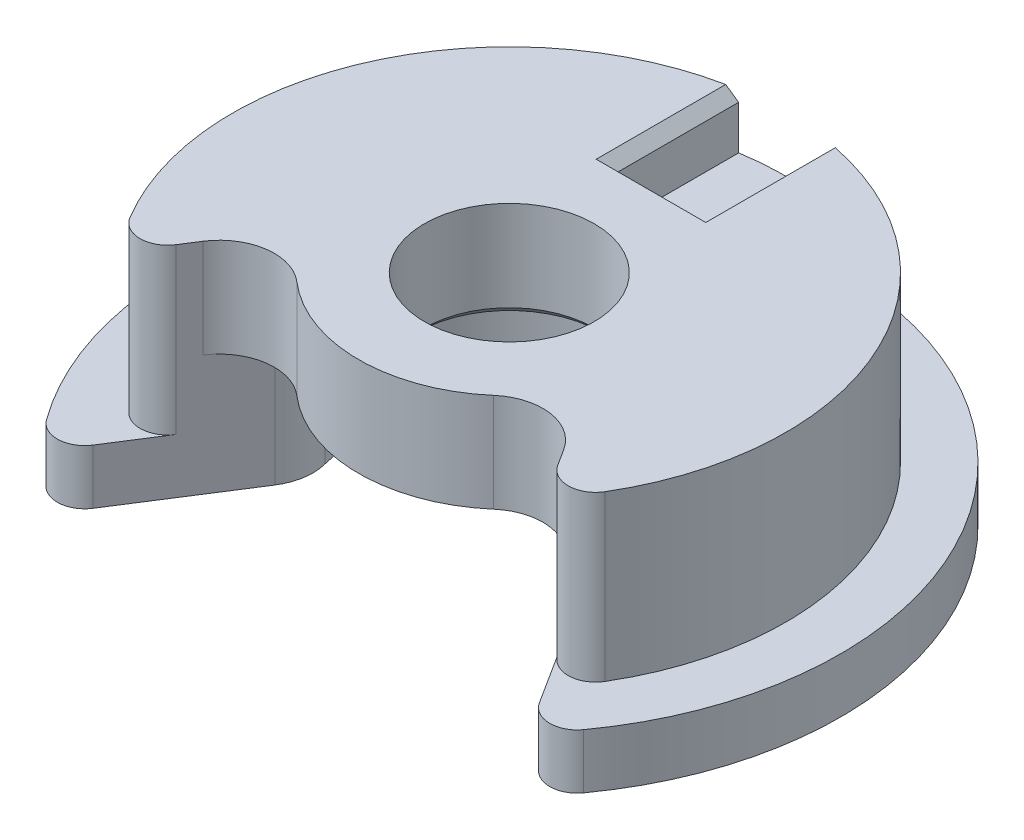
ISO-10303-21;
HEADER;
FILE_DESCRIPTION(('STEP AP214'),'2;1');
FILE_NAME('part.step','',(''),(''),'','','');
FILE_SCHEMA(('AUTOMOTIVE_DESIGN { 1 0 10303 214 1 1 1 1 }'));
ENDSEC;
DATA;
#1=APPLICATION_CONTEXT('core data for automotive mechanical design processes');
#2=APPLICATION_PROTOCOL_DEFINITION('international standard','automotive_design',2000,#1);
#3=PRODUCT_CONTEXT('',#1,'mechanical');
#4=PRODUCT('Part','Part','',(#3));
#5=PRODUCT_RELATED_PRODUCT_CATEGORY('part','',(#4));
#6=PRODUCT_DEFINITION_FORMATION('','',#4);
#7=PRODUCT_DEFINITION_CONTEXT('part definition',#1,'design');
#8=PRODUCT_DEFINITION('design','',#6,#7);
#9=PRODUCT_DEFINITION_SHAPE('','',#8);
#10=(LENGTH_UNIT() NAMED_UNIT(*) SI_UNIT(.MILLI.,.METRE.));
#11=(NAMED_UNIT(*) PLANE_ANGLE_UNIT() SI_UNIT($,.RADIAN.));
#12=(NAMED_UNIT(*) SI_UNIT($,.STERADIAN.) SOLID_ANGLE_UNIT());
#13=UNCERTAINTY_MEASURE_WITH_UNIT(LENGTH_MEASURE(1.E-05),#10,'distance_accuracy_value','');
#14=(GEOMETRIC_REPRESENTATION_CONTEXT(3) GLOBAL_UNCERTAINTY_ASSIGNED_CONTEXT((#13)) GLOBAL_UNIT_ASSIGNED_CONTEXT((#10,
#11,#12)) REPRESENTATION_CONTEXT('',''));
#15=CARTESIAN_POINT('',(0.,0.,0.));
#16=DIRECTION('',(0.,0.,1.));
#17=DIRECTION('',(1.,0.,0.));
#18=AXIS2_PLACEMENT_3D('',#15,#16,#17);
#19=CARTESIAN_POINT('',(0.,3.,0.));
#20=DIRECTION('',(0.,1.,0.));
#21=DIRECTION('',(0.,0.,1.));
#22=AXIS2_PLACEMENT_3D('',#19,#20,#21);
#23=PLANE('',#22);
#24=DIRECTION('',(0.,0.,-1.));
#25=VECTOR('',#24,1.);
#26=CARTESIAN_POINT('',(0.8,3.,-2.786231041578));
#27=LINE('',#26,#25);
#28=CARTESIAN_POINT('',(0.8,3.,-2.786231041578));
#29=VERTEX_POINT('',#28);
#30=CARTESIAN_POINT('',(0.8,3.,-4.9862310415782));
#31=VERTEX_POINT('',#30);
#32=EDGE_CURVE('E225',#29,#31,#27,.T.);
#33=ORIENTED_EDGE('',*,*,#32,.T.);
#34=CARTESIAN_POINT('',(0.,3.,0.));
#35=DIRECTION('',(0.,-1.,0.));
#36=DIRECTION('',(0.,0.,-1.));
#37=AXIS2_PLACEMENT_3D('',#34,#35,#36);
#38=CIRCLE('',#37,5.05);
#39=CARTESIAN_POINT('',(-0.8,3.,-4.9862310415782));
#40=VERTEX_POINT('',#39);
#41=EDGE_CURVE('E19',#31,#40,#38,.F.);
#42=ORIENTED_EDGE('',*,*,#41,.T.);
#43=DIRECTION('',(0.,0.,1.));
#44=VECTOR('',#43,1.);
#45=CARTESIAN_POINT('',(-0.8,3.,-4.986231041578));
#46=LINE('',#45,#44);
#47=CARTESIAN_POINT('',(-0.8,3.,-2.786231041578));
#48=VERTEX_POINT('',#47);
#49=EDGE_CURVE('E234',#40,#48,#46,.T.);
#50=ORIENTED_EDGE('',*,*,#49,.T.);
#51=DIRECTION('',(1.,0.,0.));
#52=VECTOR('',#51,1.);
#53=CARTESIAN_POINT('',(-0.8,3.,-2.786231041578));
#54=LINE('',#53,#52);
#55=EDGE_CURVE('E158',#48,#29,#54,.T.);
#56=ORIENTED_EDGE('',*,*,#55,.T.);
#57=EDGE_LOOP('',(#33,#42,#50,#56));
#58=FACE_BOUND('',#57,.T.);
#59=ADVANCED_FACE('F16',(#58),#23,.T.);
#60=CARTESIAN_POINT('',(-0.8,4.,-2.786231041578));
#61=DIRECTION('',(0.,0.,1.));
#62=DIRECTION('',(1.,0.,0.));
#63=AXIS2_PLACEMENT_3D('',#60,#61,#62);
#64=PLANE('',#63);
#65=ORIENTED_EDGE('',*,*,#55,.F.);
#66=DIRECTION('',(0.,1.,0.));
#67=VECTOR('',#66,1.);
#68=CARTESIAN_POINT('',(-0.8,4.,-2.786231041578));
#69=LINE('',#68,#67);
#70=CARTESIAN_POINT('',(-0.800000000000001,3.8,-2.786231041578));
#71=VERTEX_POINT('',#70);
#72=EDGE_CURVE('E229',#48,#71,#69,.T.);
#73=ORIENTED_EDGE('',*,*,#72,.T.);
#74=DIRECTION('',(1.,0.,0.));
#75=VECTOR('',#74,1.);
#76=CARTESIAN_POINT('',(0.,3.8,-2.786231041578));
#77=LINE('',#76,#75);
#78=CARTESIAN_POINT('',(0.8,3.8,-2.786231041578));
#79=VERTEX_POINT('',#78);
#80=EDGE_CURVE('E217',#79,#71,#77,.F.);
#81=ORIENTED_EDGE('',*,*,#80,.F.);
#82=DIRECTION('',(0.,1.,0.));
#83=VECTOR('',#82,1.);
#84=CARTESIAN_POINT('',(0.8,4.,-2.786231041578));
#85=LINE('',#84,#83);
#86=EDGE_CURVE('E226',#79,#29,#85,.F.);
#87=ORIENTED_EDGE('',*,*,#86,.T.);
#88=EDGE_LOOP('',(#65,#73,#81,#87));
#89=FACE_BOUND('',#88,.T.);
#90=ADVANCED_FACE('F408',(#89),#64,.F.);
#91=CARTESIAN_POINT('',(-0.8,4.,-4.986231041578));
#92=DIRECTION('',(-1.,0.,0.));
#93=DIRECTION('',(0.,0.,1.));
#94=AXIS2_PLACEMENT_3D('',#91,#92,#93);
#95=PLANE('',#94);
#96=ORIENTED_EDGE('',*,*,#49,.F.);
#97=DIRECTION('',(0.,1.,0.));
#98=VECTOR('',#97,1.);
#99=CARTESIAN_POINT('',(-0.8,4.,-4.986231041578));
#100=LINE('',#99,#98);
#101=CARTESIAN_POINT('',(-0.8,3.8,-4.9862310415782));
#102=VERTEX_POINT('',#101);
#103=EDGE_CURVE('E232',#102,#40,#100,.F.);
#104=ORIENTED_EDGE('',*,*,#103,.F.);
#105=DIRECTION('',(0.,0.,1.));
#106=VECTOR('',#105,1.);
#107=CARTESIAN_POINT('',(-0.8,3.8,-3.868115520789));
#108=LINE('',#107,#106);
#109=EDGE_CURVE('E210',#71,#102,#108,.F.);
#110=ORIENTED_EDGE('',*,*,#109,.F.);
#111=ORIENTED_EDGE('',*,*,#72,.F.);
#112=EDGE_LOOP('',(#96,#104,#110,#111));
#113=FACE_BOUND('',#112,.T.);
#114=ADVANCED_FACE('F649',(#113),#95,.F.);
#115=CARTESIAN_POINT('',(0.8,4.,-2.786231041578));
#116=DIRECTION('',(1.,0.,0.));
#117=DIRECTION('',(0.,0.,-1.));
#118=AXIS2_PLACEMENT_3D('',#115,#116,#117);
#119=PLANE('',#118);
#120=ORIENTED_EDGE('',*,*,#32,.F.);
#121=ORIENTED_EDGE('',*,*,#86,.F.);
#122=DIRECTION('',(0.,0.,1.));
#123=VECTOR('',#122,1.);
#124=CARTESIAN_POINT('',(0.8,3.8,-3.868115520789));
#125=LINE('',#124,#123);
#126=CARTESIAN_POINT('',(0.8,3.8,-4.9862310415782));
#127=VERTEX_POINT('',#126);
#128=EDGE_CURVE('E178',#127,#79,#125,.T.);
#129=ORIENTED_EDGE('',*,*,#128,.F.);
#130=DIRECTION('',(0.,1.,0.));
#131=VECTOR('',#130,1.);
#132=CARTESIAN_POINT('',(0.8,4.,-4.986231041578));
#133=LINE('',#132,#131);
#134=EDGE_CURVE('E221',#31,#127,#133,.T.);
#135=ORIENTED_EDGE('',*,*,#134,.F.);
#136=EDGE_LOOP('',(#120,#121,#129,#135));
#137=FACE_BOUND('',#136,.T.);
#138=ADVANCED_FACE('F406',(#137),#119,.F.);
#139=CARTESIAN_POINT('',(0.,3.9,-2.686231041578));
#140=DIRECTION('',(0.,0.707106781186548,-0.707106781186548));
#141=DIRECTION('',(0.,0.707106781186548,0.707106781186548));
#142=AXIS2_PLACEMENT_3D('',#139,#140,#141);
#143=PLANE('',#142);
#144=DIRECTION('',(0.577350269189625,-0.577350269189625,-0.577350269189627));
#145=VECTOR('',#144,1.);
#146=CARTESIAN_POINT('',(-1.,4.,-2.586231041578));
#147=LINE('',#146,#145);
#148=CARTESIAN_POINT('',(-1.,4.,-2.586231041578));
#149=VERTEX_POINT('',#148);
#150=EDGE_CURVE('E196',#149,#71,#147,.T.);
#151=ORIENTED_EDGE('',*,*,#150,.F.);
#152=DIRECTION('',(1.,0.,0.));
#153=VECTOR('',#152,1.);
#154=CARTESIAN_POINT('',(0.,4.,-2.586231041578));
#155=LINE('',#154,#153);
#156=CARTESIAN_POINT('',(1.,4.,-2.586231041578));
#157=VERTEX_POINT('',#156);
#158=EDGE_CURVE('E187',#157,#149,#155,.F.);
#159=ORIENTED_EDGE('',*,*,#158,.F.);
#160=DIRECTION('',(0.577350269189625,0.577350269189625,0.577350269189627));
#161=VECTOR('',#160,1.);
#162=CARTESIAN_POINT('',(0.8,3.8,-2.786231041578));
#163=LINE('',#162,#161);
#164=EDGE_CURVE('E171',#79,#157,#163,.T.);
#165=ORIENTED_EDGE('',*,*,#164,.F.);
#166=ORIENTED_EDGE('',*,*,#80,.T.);
#167=EDGE_LOOP('',(#151,#159,#165,#166));
#168=FACE_BOUND('',#167,.T.);
#169=ADVANCED_FACE('F194',(#168),#143,.T.);
#170=CARTESIAN_POINT('',(-0.9,3.9,-3.868115520789));
#171=DIRECTION('',(0.707106781186548,0.707106781186548,0.));
#172=DIRECTION('',(-0.707106781186548,0.707106781186548,0.));
#173=AXIS2_PLACEMENT_3D('',#170,#171,#172);
#174=PLANE('',#173);
#175=ORIENTED_EDGE('',*,*,#109,.T.);
#176=CARTESIAN_POINT('',(0.,3.,0.));
#177=DIRECTION('',(0.707106781186548,0.707106781186548,0.));
#178=DIRECTION('',(0.707106781186548,-0.707106781186548,0.));
#179=AXIS2_PLACEMENT_3D('',#176,#177,#178);
#180=ELLIPSE('',#179,7.14177848998413,5.05);
#181=CARTESIAN_POINT('',(-1.,4.,-4.95));
#182=VERTEX_POINT('',#181);
#183=EDGE_CURVE('E213',#102,#182,#180,.T.);
#184=ORIENTED_EDGE('',*,*,#183,.T.);
#185=DIRECTION('',(0.,0.,1.));
#186=VECTOR('',#185,1.);
#187=CARTESIAN_POINT('',(-1.,4.,0.));
#188=LINE('',#187,#186);
#189=EDGE_CURVE('E198',#149,#182,#188,.F.);
#190=ORIENTED_EDGE('',*,*,#189,.F.);
#191=ORIENTED_EDGE('',*,*,#150,.T.);
#192=EDGE_LOOP('',(#175,#184,#190,#191));
#193=FACE_BOUND('',#192,.T.);
#194=ADVANCED_FACE('F411',(#193),#174,.T.);
#195=CARTESIAN_POINT('',(0.9,3.9,-3.868115520789));
#196=DIRECTION('',(-0.707106781186548,0.707106781186548,0.));
#197=DIRECTION('',(-0.707106781186548,-0.707106781186548,0.));
#198=AXIS2_PLACEMENT_3D('',#195,#196,#197);
#199=PLANE('',#198);
#200=DIRECTION('',(0.,0.,1.));
#201=VECTOR('',#200,1.);
#202=CARTESIAN_POINT('',(1.,4.,0.));
#203=LINE('',#202,#201);
#204=CARTESIAN_POINT('',(1.,4.,-4.95));
#205=VERTEX_POINT('',#204);
#206=EDGE_CURVE('E175',#205,#157,#203,.T.);
#207=ORIENTED_EDGE('',*,*,#206,.F.);
#208=CARTESIAN_POINT('',(0.,3.,0.));
#209=DIRECTION('',(-0.707106781186548,0.707106781186548,0.));
#210=DIRECTION('',(-0.707106781186548,-0.707106781186548,0.));
#211=AXIS2_PLACEMENT_3D('',#208,#209,#210);
#212=ELLIPSE('',#211,7.14177848998413,5.05);
#213=EDGE_CURVE('E182',#205,#127,#212,.T.);
#214=ORIENTED_EDGE('',*,*,#213,.T.);
#215=ORIENTED_EDGE('',*,*,#128,.T.);
#216=ORIENTED_EDGE('',*,*,#164,.T.);
#217=EDGE_LOOP('',(#207,#214,#215,#216));
#218=FACE_BOUND('',#217,.T.);
#219=ADVANCED_FACE('F173',(#218),#199,.T.);
#220=CARTESIAN_POINT('',(0.,0.,0.));
#221=DIRECTION('',(0.,-1.,0.));
#222=DIRECTION('',(0.,0.,-1.));
#223=AXIS2_PLACEMENT_3D('',#220,#221,#222);
#224=CYLINDRICAL_SURFACE('',#223,1.55);
#225=CARTESIAN_POINT('',(0.,4.,0.));
#226=DIRECTION('',(0.,-1.,0.));
#227=DIRECTION('',(0.,0.,-1.));
#228=AXIS2_PLACEMENT_3D('',#225,#226,#227);
#229=CIRCLE('',#228,1.55);
#230=CARTESIAN_POINT('',(0.,4.,-1.55));
#231=VERTEX_POINT('',#230);
#232=EDGE_CURVE('E191',#231,#231,#229,.T.);
#233=ORIENTED_EDGE('',*,*,#232,.F.);
#234=EDGE_LOOP('',(#233));
#235=FACE_BOUND('',#234,.T.);
#236=CARTESIAN_POINT('',(0.,2.35000000003538,0.));
#237=DIRECTION('',(0.,-1.,0.));
#238=DIRECTION('',(0.,0.,-1.));
#239=AXIS2_PLACEMENT_3D('',#236,#237,#238);
#240=CIRCLE('',#239,1.55000000000882);
#241=CARTESIAN_POINT('',(0.,2.35000000003538,-1.55000000000882));
#242=VERTEX_POINT('',#241);
#243=EDGE_CURVE('E199',#242,#242,#240,.T.);
#244=ORIENTED_EDGE('',*,*,#243,.T.);
#245=EDGE_LOOP('',(#244));
#246=FACE_BOUND('',#245,.T.);
#247=ADVANCED_FACE('F454',(#235,#246),#224,.F.);
#248=CARTESIAN_POINT('',(0.,2.20000000007303,0.));
#249=DIRECTION('',(0.,-1.,0.));
#250=DIRECTION('',(0.,0.,-1.));
#251=AXIS2_PLACEMENT_3D('',#248,#249,#250);
#252=CONICAL_SURFACE('',#251,1.69999999997117,0.785398163397448);
#253=CARTESIAN_POINT('',(0.,2.20000000007303,0.));
#254=DIRECTION('',(0.,-1.,0.));
#255=DIRECTION('',(0.,0.,-1.));
#256=AXIS2_PLACEMENT_3D('',#253,#254,#255);
#257=CIRCLE('',#256,1.69999999997117);
#258=CARTESIAN_POINT('',(0.,2.20000000007303,-1.69999999997117));
#259=VERTEX_POINT('',#258);
#260=EDGE_CURVE('E294',#259,#259,#257,.F.);
#261=ORIENTED_EDGE('',*,*,#260,.F.);
#262=EDGE_LOOP('',(#261));
#263=FACE_BOUND('',#262,.T.);
#264=ORIENTED_EDGE('',*,*,#243,.F.);
#265=EDGE_LOOP('',(#264));
#266=FACE_BOUND('',#265,.T.);
#267=ADVANCED_FACE('F445',(#263,#266),#252,.F.);
#268=CARTESIAN_POINT('',(0.,0.,0.));
#269=DIRECTION('',(0.,-1.,0.));
#270=DIRECTION('',(0.,0.,-1.));
#271=AXIS2_PLACEMENT_3D('',#268,#269,#270);
#272=CYLINDRICAL_SURFACE('',#271,2.75);
#273=CARTESIAN_POINT('',(0.,2.2,0.));
#274=DIRECTION('',(0.,-1.,0.));
#275=DIRECTION('',(0.,0.,-1.));
#276=AXIS2_PLACEMENT_3D('',#273,#274,#275);
#277=CIRCLE('',#276,2.75);
#278=CARTESIAN_POINT('',(1.7973072600179,2.2,2.081390547948));
#279=VERTEX_POINT('',#278);
#280=CARTESIAN_POINT('',(-1.7973072600179,2.2,2.081390547948));
#281=VERTEX_POINT('',#280);
#282=EDGE_CURVE('E301',#279,#281,#277,.T.);
#283=ORIENTED_EDGE('',*,*,#282,.F.);
#284=DIRECTION('',(0.,1.,0.));
#285=VECTOR('',#284,1.);
#286=CARTESIAN_POINT('',(1.797307260018,-5.2144,2.081390547948));
#287=LINE('',#286,#285);
#288=CARTESIAN_POINT('',(1.7973072600179,4.,2.081390547948));
#289=VERTEX_POINT('',#288);
#290=EDGE_CURVE('E286',#279,#289,#287,.T.);
#291=ORIENTED_EDGE('',*,*,#290,.T.);
#292=CARTESIAN_POINT('',(0.,4.,0.));
#293=DIRECTION('',(0.,-1.,0.));
#294=DIRECTION('',(0.,0.,-1.));
#295=AXIS2_PLACEMENT_3D('',#292,#293,#294);
#296=CIRCLE('',#295,2.75);
#297=CARTESIAN_POINT('',(-1.7973072600179,4.,2.081390547948));
#298=VERTEX_POINT('',#297);
#299=EDGE_CURVE('E322',#298,#289,#296,.F.);
#300=ORIENTED_EDGE('',*,*,#299,.F.);
#301=DIRECTION('',(0.,1.,0.));
#302=VECTOR('',#301,1.);
#303=CARTESIAN_POINT('',(-1.797307260018,-5.2144,2.081390547948));
#304=LINE('',#303,#302);
#305=EDGE_CURVE('E309',#298,#281,#304,.F.);
#306=ORIENTED_EDGE('',*,*,#305,.T.);
#307=EDGE_LOOP('',(#283,#291,#300,#306));
#308=FACE_BOUND('',#307,.T.);
#309=ADVANCED_FACE('F443',(#308),#272,.T.);
#310=CARTESIAN_POINT('',(0.,4.,0.));
#311=DIRECTION('',(0.,1.,0.));
#312=DIRECTION('',(0.,0.,1.));
#313=AXIS2_PLACEMENT_3D('',#310,#311,#312);
#314=PLANE('',#313);
#315=ORIENTED_EDGE('',*,*,#232,.T.);
#316=EDGE_LOOP('',(#315));
#317=FACE_BOUND('',#316,.T.);
#318=CARTESIAN_POINT('',(0.,4.,0.));
#319=DIRECTION('',(0.,-1.,0.));
#320=DIRECTION('',(0.,0.,-1.));
#321=AXIS2_PLACEMENT_3D('',#318,#319,#320);
#322=CIRCLE('',#321,5.05);
#323=CARTESIAN_POINT('',(4.33625103973418,4.,2.5883251187598));
#324=VERTEX_POINT('',#323);
#325=EDGE_CURVE('E190',#205,#324,#322,.T.);
#326=ORIENTED_EDGE('',*,*,#325,.F.);
#327=ORIENTED_EDGE('',*,*,#206,.T.);
#328=ORIENTED_EDGE('',*,*,#158,.T.);
#329=ORIENTED_EDGE('',*,*,#189,.T.);
#330=CARTESIAN_POINT('',(0.,4.,0.));
#331=DIRECTION('',(0.,-1.,0.));
#332=DIRECTION('',(0.,0.,-1.));
#333=AXIS2_PLACEMENT_3D('',#330,#331,#332);
#334=CIRCLE('',#333,5.05);
#335=CARTESIAN_POINT('',(-4.33625103973424,4.,2.58832511875984));
#336=VERTEX_POINT('',#335);
#337=EDGE_CURVE('E314',#336,#182,#334,.T.);
#338=ORIENTED_EDGE('',*,*,#337,.F.);
#339=CARTESIAN_POINT('',(-3.906919253622,4.,2.332055305021));
#340=DIRECTION('',(0.,1.,0.));
#341=DIRECTION('',(0.,0.,1.));
#342=AXIS2_PLACEMENT_3D('',#339,#340,#341);
#343=CIRCLE('',#342,0.5);
#344=CARTESIAN_POINT('',(-3.48522353071745,4.,2.60070510919377));
#345=VERTEX_POINT('',#344);
#346=EDGE_CURVE('E310',#345,#336,#343,.F.);
#347=ORIENTED_EDGE('',*,*,#346,.F.);
#348=DIRECTION('',(0.537299608347189,0.,-0.843391445812653));
#349=VECTOR('',#348,1.);
#350=CARTESIAN_POINT('',(-3.485223530716,4.,2.600705109195));
#351=LINE('',#350,#349);
#352=CARTESIAN_POINT('',(-3.29426498220257,4.,2.3009602297628));
#353=VERTEX_POINT('',#352);
#354=EDGE_CURVE('E201',#345,#353,#351,.T.);
#355=ORIENTED_EDGE('',*,*,#354,.T.);
#356=CARTESIAN_POINT('',(-2.450873536388,4.,2.838259838111));
#357=DIRECTION('',(0.,1.,0.));
#358=DIRECTION('',(0.,0.,1.));
#359=AXIS2_PLACEMENT_3D('',#356,#357,#358);
#360=CIRCLE('',#359,1.);
#361=EDGE_CURVE('E306',#353,#298,#360,.F.);
#362=ORIENTED_EDGE('',*,*,#361,.T.);
#363=ORIENTED_EDGE('',*,*,#299,.T.);
#364=CARTESIAN_POINT('',(2.450873536388,4.,2.838259838111));
#365=DIRECTION('',(0.,1.,0.));
#366=DIRECTION('',(0.,0.,1.));
#367=AXIS2_PLACEMENT_3D('',#364,#365,#366);
#368=CIRCLE('',#367,1.);
#369=CARTESIAN_POINT('',(3.29426498220077,4.,2.30096022976394));
#370=VERTEX_POINT('',#369);
#371=EDGE_CURVE('E283',#289,#370,#368,.F.);
#372=ORIENTED_EDGE('',*,*,#371,.T.);
#373=DIRECTION('',(0.537299608347189,0.,0.843391445812653));
#374=VECTOR('',#373,1.);
#375=CARTESIAN_POINT('',(3.294264982201,4.,2.300960229764));
#376=LINE('',#375,#374);
#377=CARTESIAN_POINT('',(3.48522353071566,4.,2.60070510919491));
#378=VERTEX_POINT('',#377);
#379=EDGE_CURVE('E321',#370,#378,#376,.T.);
#380=ORIENTED_EDGE('',*,*,#379,.T.);
#381=CARTESIAN_POINT('',(3.906919253622,4.,2.332055305021));
#382=DIRECTION('',(0.,-1.,0.));
#383=DIRECTION('',(0.,0.,-1.));
#384=AXIS2_PLACEMENT_3D('',#381,#382,#383);
#385=CIRCLE('',#384,0.5);
#386=EDGE_CURVE('E192',#378,#324,#385,.F.);
#387=ORIENTED_EDGE('',*,*,#386,.T.);
#388=EDGE_LOOP('',(#326,#327,#328,#329,#338,#347,#355,#362,#363,#372,#380,#387));
#389=FACE_BOUND('',#388,.T.);
#390=ADVANCED_FACE('F185',(#317,#389),#314,.T.);
#391=CARTESIAN_POINT('',(0.,1.,0.));
#392=DIRECTION('',(0.,-1.,0.));
#393=DIRECTION('',(0.,0.,-1.));
#394=AXIS2_PLACEMENT_3D('',#391,#392,#393);
#395=CYLINDRICAL_SURFACE('',#394,5.05);
#396=ORIENTED_EDGE('',*,*,#134,.T.);
#397=ORIENTED_EDGE('',*,*,#213,.F.);
#398=ORIENTED_EDGE('',*,*,#325,.T.);
#399=DIRECTION('',(0.,-1.,0.));
#400=VECTOR('',#399,1.);
#401=CARTESIAN_POINT('',(4.33625103973405,9.2144,2.58832511876003));
#402=LINE('',#401,#400);
#403=CARTESIAN_POINT('',(4.33625103973424,1.,2.58832511875984));
#404=VERTEX_POINT('',#403);
#405=EDGE_CURVE('E282',#404,#324,#402,.F.);
#406=ORIENTED_EDGE('',*,*,#405,.F.);
#407=CARTESIAN_POINT('',(0.,1.,0.));
#408=DIRECTION('',(0.,-1.,0.));
#409=DIRECTION('',(0.,0.,-1.));
#410=AXIS2_PLACEMENT_3D('',#407,#408,#409);
#411=CIRCLE('',#410,5.05);
#412=CARTESIAN_POINT('',(-4.33625103973418,1.,2.5883251187598));
#413=VERTEX_POINT('',#412);
#414=EDGE_CURVE('E276',#404,#413,#411,.F.);
#415=ORIENTED_EDGE('',*,*,#414,.T.);
#416=DIRECTION('',(0.,1.,0.));
#417=VECTOR('',#416,1.);
#418=CARTESIAN_POINT('',(-4.33625103973405,-5.2144,2.58832511876003));
#419=LINE('',#418,#417);
#420=EDGE_CURVE('E313',#336,#413,#419,.F.);
#421=ORIENTED_EDGE('',*,*,#420,.F.);
#422=ORIENTED_EDGE('',*,*,#337,.T.);
#423=ORIENTED_EDGE('',*,*,#183,.F.);
#424=ORIENTED_EDGE('',*,*,#103,.T.);
#425=ORIENTED_EDGE('',*,*,#41,.F.);
#426=EDGE_LOOP('',(#396,#397,#398,#406,#415,#421,#422,#423,#424,#425));
#427=FACE_BOUND('',#426,.T.);
#428=ADVANCED_FACE('F404',(#427),#395,.T.);
#429=CARTESIAN_POINT('',(-3.906919253622,-5.2144,2.332055305021));
#430=DIRECTION('',(0.,1.,0.));
#431=DIRECTION('',(0.,0.,1.));
#432=AXIS2_PLACEMENT_3D('',#429,#430,#431);
#433=CYLINDRICAL_SURFACE('',#432,0.5);
#434=DIRECTION('',(0.,1.,0.));
#435=VECTOR('',#434,1.);
#436=CARTESIAN_POINT('',(-3.48522353071918,0.,2.60070510919297));
#437=LINE('',#436,#435);
#438=CARTESIAN_POINT('',(-3.48522353071898,1.,2.60070510919266));
#439=VERTEX_POINT('',#438);
#440=EDGE_CURVE('E272',#439,#345,#437,.T.);
#441=ORIENTED_EDGE('',*,*,#440,.T.);
#442=ORIENTED_EDGE('',*,*,#346,.T.);
#443=ORIENTED_EDGE('',*,*,#420,.T.);
#444=CARTESIAN_POINT('',(-3.906919253622,1.,2.332055305021));
#445=DIRECTION('',(0.,1.,0.));
#446=DIRECTION('',(0.,0.,1.));
#447=AXIS2_PLACEMENT_3D('',#444,#445,#446);
#448=CIRCLE('',#447,0.5);
#449=EDGE_CURVE('E273',#413,#439,#448,.T.);
#450=ORIENTED_EDGE('',*,*,#449,.T.);
#451=EDGE_LOOP('',(#441,#442,#443,#450));
#452=FACE_BOUND('',#451,.T.);
#453=ADVANCED_FACE('F416',(#452),#433,.T.);
#454=CARTESIAN_POINT('',(-2.450873536388,-5.2144,2.838259838111));
#455=DIRECTION('',(0.,1.,0.));
#456=DIRECTION('',(0.,0.,1.));
#457=AXIS2_PLACEMENT_3D('',#454,#455,#456);
#458=CYLINDRICAL_SURFACE('',#457,1.);
#459=DIRECTION('',(0.,1.,0.));
#460=VECTOR('',#459,1.);
#461=CARTESIAN_POINT('',(-3.29426498220432,0.,2.30096022976188));
#462=LINE('',#461,#460);
#463=CARTESIAN_POINT('',(-3.29426498220435,2.2,2.30096022976193));
#464=VERTEX_POINT('',#463);
#465=EDGE_CURVE('E347',#353,#464,#462,.F.);
#466=ORIENTED_EDGE('',*,*,#465,.T.);
#467=CARTESIAN_POINT('',(-2.450873536388,2.2,2.838259838111));
#468=DIRECTION('',(0.,1.,0.));
#469=DIRECTION('',(0.,0.,1.));
#470=AXIS2_PLACEMENT_3D('',#467,#468,#469);
#471=CIRCLE('',#470,1.);
#472=EDGE_CURVE('E299',#281,#464,#471,.T.);
#473=ORIENTED_EDGE('',*,*,#472,.F.);
#474=ORIENTED_EDGE('',*,*,#305,.F.);
#475=ORIENTED_EDGE('',*,*,#361,.F.);
#476=EDGE_LOOP('',(#466,#473,#474,#475));
#477=FACE_BOUND('',#476,.T.);
#478=ADVANCED_FACE('F433',(#477),#458,.F.);
#479=CARTESIAN_POINT('',(-3.625222931046,9.2144,0.9593011519948));
#480=DIRECTION('',(0.,-1.,0.));
#481=DIRECTION('',(0.,0.,-1.));
#482=AXIS2_PLACEMENT_3D('',#479,#480,#481);
#483=CYLINDRICAL_SURFACE('',#482,1.);
#484=DIRECTION('',(0.,1.,0.));
#485=VECTOR('',#484,1.);
#486=CARTESIAN_POINT('',(-2.78183148523659,0.,1.49660076033971));
#487=LINE('',#486,#485);
#488=CARTESIAN_POINT('',(-2.78183148523651,2.2,1.49660076033959));
#489=VERTEX_POINT('',#488);
#490=CARTESIAN_POINT('',(-2.78183148523472,0.,1.49660076034074));
#491=VERTEX_POINT('',#490);
#492=EDGE_CURVE('E353',#489,#491,#487,.F.);
#493=ORIENTED_EDGE('',*,*,#492,.T.);
#494=CARTESIAN_POINT('',(-3.625222931046,0.,0.9593011519948));
#495=DIRECTION('',(0.,-1.,0.));
#496=DIRECTION('',(0.,0.,-1.));
#497=AXIS2_PLACEMENT_3D('',#494,#495,#496);
#498=CIRCLE('',#497,1.);
#499=CARTESIAN_POINT('',(-2.65849681610037,0.,0.703487511462923));
#500=VERTEX_POINT('',#499);
#501=EDGE_CURVE('E304',#491,#500,#498,.F.);
#502=ORIENTED_EDGE('',*,*,#501,.T.);
#503=DIRECTION('',(0.,-1.,0.));
#504=VECTOR('',#503,1.);
#505=CARTESIAN_POINT('',(-2.65849681610033,0.,0.703487511462989));
#506=LINE('',#505,#504);
#507=CARTESIAN_POINT('',(-2.65849681610037,2.2,0.703487511462923));
#508=VERTEX_POINT('',#507);
#509=EDGE_CURVE('E269',#500,#508,#506,.F.);
#510=ORIENTED_EDGE('',*,*,#509,.T.);
#511=CARTESIAN_POINT('',(-3.625222931046,2.2,0.9593011519948));
#512=DIRECTION('',(0.,-1.,0.));
#513=DIRECTION('',(0.,0.,-1.));
#514=AXIS2_PLACEMENT_3D('',#511,#512,#513);
#515=CIRCLE('',#514,1.);
#516=EDGE_CURVE('E297',#489,#508,#515,.F.);
#517=ORIENTED_EDGE('',*,*,#516,.F.);
#518=EDGE_LOOP('',(#493,#502,#510,#517));
#519=FACE_BOUND('',#518,.T.);
#520=ADVANCED_FACE('F489',(#519),#483,.T.);
#521=CARTESIAN_POINT('',(0.,2.2,0.));
#522=DIRECTION('',(0.,-1.,0.));
#523=DIRECTION('',(0.,0.,-1.));
#524=AXIS2_PLACEMENT_3D('',#521,#522,#523);
#525=PLANE('',#524);
#526=ORIENTED_EDGE('',*,*,#260,.T.);
#527=EDGE_LOOP('',(#526));
#528=FACE_BOUND('',#527,.T.);
#529=ORIENTED_EDGE('',*,*,#516,.T.);
#530=CARTESIAN_POINT('',(0.,2.2,0.));
#531=DIRECTION('',(0.,-1.,0.));
#532=DIRECTION('',(0.,0.,-1.));
#533=AXIS2_PLACEMENT_3D('',#530,#531,#532);
#534=CIRCLE('',#533,2.75);
#535=CARTESIAN_POINT('',(2.65849681610037,2.2,0.703487511462922));
#536=VERTEX_POINT('',#535);
#537=EDGE_CURVE('E265',#508,#536,#534,.T.);
#538=ORIENTED_EDGE('',*,*,#537,.T.);
#539=CARTESIAN_POINT('',(3.625222931046,2.2,0.9593011519948));
#540=DIRECTION('',(0.,1.,0.));
#541=DIRECTION('',(0.,0.,1.));
#542=AXIS2_PLACEMENT_3D('',#539,#540,#541);
#543=CIRCLE('',#542,1.);
#544=CARTESIAN_POINT('',(2.78183148523301,2.2,1.49660076034202));
#545=VERTEX_POINT('',#544);
#546=EDGE_CURVE('E292',#545,#536,#543,.F.);
#547=ORIENTED_EDGE('',*,*,#546,.F.);
#548=DIRECTION('',(0.537299608347085,0.,0.84339144581272));
#549=VECTOR('',#548,1.);
#550=CARTESIAN_POINT('',(2.781831485233,2.2,1.496600760342));
#551=LINE('',#550,#549);
#552=CARTESIAN_POINT('',(3.2942649822008,2.2,2.30096022976399));
#553=VERTEX_POINT('',#552);
#554=EDGE_CURVE('E303',#545,#553,#551,.T.);
#555=ORIENTED_EDGE('',*,*,#554,.T.);
#556=CARTESIAN_POINT('',(2.450873536388,2.2,2.838259838111));
#557=DIRECTION('',(0.,1.,0.));
#558=DIRECTION('',(0.,0.,1.));
#559=AXIS2_PLACEMENT_3D('',#556,#557,#558);
#560=CIRCLE('',#559,1.);
#561=EDGE_CURVE('E287',#553,#279,#560,.T.);
#562=ORIENTED_EDGE('',*,*,#561,.T.);
#563=ORIENTED_EDGE('',*,*,#282,.T.);
#564=ORIENTED_EDGE('',*,*,#472,.T.);
#565=DIRECTION('',(-0.5372996083468,0.,0.843391445812901));
#566=VECTOR('',#565,1.);
#567=CARTESIAN_POINT('',(-13.10883712567,2.2,17.70675256894));
#568=LINE('',#567,#566);
#569=EDGE_CURVE('E350',#464,#489,#568,.F.);
#570=ORIENTED_EDGE('',*,*,#569,.T.);
#571=EDGE_LOOP('',(#529,#538,#547,#555,#562,#563,#564,#570));
#572=FACE_BOUND('',#571,.T.);
#573=ADVANCED_FACE('F429',(#528,#572),#525,.T.);
#574=CARTESIAN_POINT('',(3.625222931046,-5.2144,0.9593011519948));
#575=DIRECTION('',(0.,1.,0.));
#576=DIRECTION('',(0.,0.,1.));
#577=AXIS2_PLACEMENT_3D('',#574,#575,#576);
#578=CYLINDRICAL_SURFACE('',#577,1.);
#579=CARTESIAN_POINT('',(3.625222931046,0.,0.9593011519948));
#580=DIRECTION('',(0.,1.,0.));
#581=DIRECTION('',(0.,0.,1.));
#582=AXIS2_PLACEMENT_3D('',#579,#580,#581);
#583=CIRCLE('',#582,1.);
#584=CARTESIAN_POINT('',(2.65849681610037,0.,0.703487511462922));
#585=VERTEX_POINT('',#584);
#586=CARTESIAN_POINT('',(2.78183148523292,0.,1.49660076034188));
#587=VERTEX_POINT('',#586);
#588=EDGE_CURVE('E290',#585,#587,#583,.T.);
#589=ORIENTED_EDGE('',*,*,#588,.T.);
#590=DIRECTION('',(0.,1.,0.));
#591=VECTOR('',#590,1.);
#592=CARTESIAN_POINT('',(2.781831485233,0.,1.496600760342));
#593=LINE('',#592,#591);
#594=EDGE_CURVE('E268',#587,#545,#593,.T.);
#595=ORIENTED_EDGE('',*,*,#594,.T.);
#596=ORIENTED_EDGE('',*,*,#546,.T.);
#597=DIRECTION('',(0.,-1.,0.));
#598=VECTOR('',#597,1.);
#599=CARTESIAN_POINT('',(2.65849681610033,0.,0.703487511462988));
#600=LINE('',#599,#598);
#601=EDGE_CURVE('E359',#536,#585,#600,.T.);
#602=ORIENTED_EDGE('',*,*,#601,.T.);
#603=EDGE_LOOP('',(#589,#595,#596,#602));
#604=FACE_BOUND('',#603,.T.);
#605=ADVANCED_FACE('F483',(#604),#578,.T.);
#606=CARTESIAN_POINT('',(2.450873536388,-5.2144,2.838259838111));
#607=DIRECTION('',(0.,1.,0.));
#608=DIRECTION('',(0.,0.,1.));
#609=AXIS2_PLACEMENT_3D('',#606,#607,#608);
#610=CYLINDRICAL_SURFACE('',#609,1.);
#611=ORIENTED_EDGE('',*,*,#290,.F.);
#612=ORIENTED_EDGE('',*,*,#561,.F.);
#613=DIRECTION('',(0.,1.,0.));
#614=VECTOR('',#613,1.);
#615=CARTESIAN_POINT('',(3.29426498220073,0.,2.30096022976417));
#616=LINE('',#615,#614);
#617=EDGE_CURVE('E332',#553,#370,#616,.T.);
#618=ORIENTED_EDGE('',*,*,#617,.T.);
#619=ORIENTED_EDGE('',*,*,#371,.F.);
#620=EDGE_LOOP('',(#611,#612,#618,#619));
#621=FACE_BOUND('',#620,.T.);
#622=ADVANCED_FACE('F440',(#621),#610,.F.);
#623=CARTESIAN_POINT('',(3.906919253622,9.2144,2.332055305021));
#624=DIRECTION('',(0.,-1.,0.));
#625=DIRECTION('',(0.,0.,-1.));
#626=AXIS2_PLACEMENT_3D('',#623,#624,#625);
#627=CYLINDRICAL_SURFACE('',#626,0.5);
#628=ORIENTED_EDGE('',*,*,#386,.F.);
#629=DIRECTION('',(0.,1.,0.));
#630=VECTOR('',#629,1.);
#631=CARTESIAN_POINT('',(3.48522353071559,0.,2.60070510919526));
#632=LINE('',#631,#630);
#633=CARTESIAN_POINT('',(3.48522353071539,0.999999999999999,2.60070510919495));
#634=VERTEX_POINT('',#633);
#635=EDGE_CURVE('E335',#378,#634,#632,.F.);
#636=ORIENTED_EDGE('',*,*,#635,.T.);
#637=CARTESIAN_POINT('',(3.906919253622,0.999999999999999,2.332055305021));
#638=DIRECTION('',(0.,-1.,0.));
#639=DIRECTION('',(0.,0.,-1.));
#640=AXIS2_PLACEMENT_3D('',#637,#638,#639);
#641=CIRCLE('',#640,0.5);
#642=EDGE_CURVE('E279',#634,#404,#641,.F.);
#643=ORIENTED_EDGE('',*,*,#642,.T.);
#644=ORIENTED_EDGE('',*,*,#405,.T.);
#645=EDGE_LOOP('',(#628,#636,#643,#644));
#646=FACE_BOUND('',#645,.T.);
#647=ADVANCED_FACE('F403',(#646),#627,.T.);
#648=CARTESIAN_POINT('',(0.,1.,0.));
#649=DIRECTION('',(0.,-1.,0.));
#650=DIRECTION('',(0.,0.,-1.));
#651=AXIS2_PLACEMENT_3D('',#648,#649,#650);
#652=PLANE('',#651);
#653=CARTESIAN_POINT('',(0.,1.,0.));
#654=DIRECTION('',(0.,1.,0.));
#655=DIRECTION('',(0.,0.,1.));
#656=AXIS2_PLACEMENT_3D('',#653,#654,#655);
#657=CIRCLE('',#656,6.05);
#658=CARTESIAN_POINT('',(-4.90003592224642,1.,3.54854166675473));
#659=VERTEX_POINT('',#658);
#660=CARTESIAN_POINT('',(4.90003592224644,1.,3.54854166675474));
#661=VERTEX_POINT('',#660);
#662=EDGE_CURVE('E259',#659,#661,#657,.F.);
#663=ORIENTED_EDGE('',*,*,#662,.F.);
#664=CARTESIAN_POINT('',(-4.49507427578,1.,3.255273760411));
#665=DIRECTION('',(0.,1.,0.));
#666=DIRECTION('',(0.,0.,1.));
#667=AXIS2_PLACEMENT_3D('',#664,#665,#666);
#668=CIRCLE('',#667,0.5);
#669=CARTESIAN_POINT('',(-4.07337855287652,1.,3.52392356458263));
#670=VERTEX_POINT('',#669);
#671=EDGE_CURVE('E270',#670,#659,#668,.F.);
#672=ORIENTED_EDGE('',*,*,#671,.F.);
#673=DIRECTION('',(-0.5372996083468,0.,0.843391445812901));
#674=VECTOR('',#673,1.);
#675=CARTESIAN_POINT('',(-13.10883712567,1.,17.70675256894));
#676=LINE('',#675,#674);
#677=EDGE_CURVE('E356',#670,#439,#676,.F.);
#678=ORIENTED_EDGE('',*,*,#677,.T.);
#679=ORIENTED_EDGE('',*,*,#449,.F.);
#680=ORIENTED_EDGE('',*,*,#414,.F.);
#681=ORIENTED_EDGE('',*,*,#642,.F.);
#682=DIRECTION('',(-0.5372996083468,0.,-0.843391445812901));
#683=VECTOR('',#682,1.);
#684=CARTESIAN_POINT('',(2.523965560062,1.,1.091832336771));
#685=LINE('',#684,#683);
#686=CARTESIAN_POINT('',(4.07337855287327,0.999999999999999,3.5239235645847));
#687=VERTEX_POINT('',#686);
#688=EDGE_CURVE('E264',#634,#687,#685,.F.);
#689=ORIENTED_EDGE('',*,*,#688,.T.);
#690=CARTESIAN_POINT('',(4.49507427578,0.999999999999999,3.255273760411));
#691=DIRECTION('',(0.,-1.,0.));
#692=DIRECTION('',(0.,0.,-1.));
#693=AXIS2_PLACEMENT_3D('',#690,#691,#692);
#694=CIRCLE('',#693,0.5);
#695=EDGE_CURVE('E262',#661,#687,#694,.T.);
#696=ORIENTED_EDGE('',*,*,#695,.F.);
#697=EDGE_LOOP('',(#663,#672,#678,#679,#680,#681,#689,#696));
#698=FACE_BOUND('',#697,.T.);
#699=ADVANCED_FACE('F399',(#698),#652,.F.);
#700=CARTESIAN_POINT('',(-4.49507427578,-5.2144,3.255273760411));
#701=DIRECTION('',(0.,1.,0.));
#702=DIRECTION('',(0.,0.,1.));
#703=AXIS2_PLACEMENT_3D('',#700,#701,#702);
#704=CYLINDRICAL_SURFACE('',#703,0.5);
#705=DIRECTION('',(0.,1.,0.));
#706=VECTOR('',#705,1.);
#707=CARTESIAN_POINT('',(-4.07337855287658,0.,3.52392356458272));
#708=LINE('',#707,#706);
#709=CARTESIAN_POINT('',(-4.07337855287473,0.,3.52392356458377));
#710=VERTEX_POINT('',#709);
#711=EDGE_CURVE('E360',#710,#670,#708,.T.);
#712=ORIENTED_EDGE('',*,*,#711,.T.);
#713=ORIENTED_EDGE('',*,*,#671,.T.);
#714=DIRECTION('',(0.,1.,0.));
#715=VECTOR('',#714,1.);
#716=CARTESIAN_POINT('',(-4.90003592224616,0.,3.54854166675512));
#717=LINE('',#716,#715);
#718=CARTESIAN_POINT('',(-4.90003592224642,0.,3.54854166675473));
#719=VERTEX_POINT('',#718);
#720=EDGE_CURVE('E258',#719,#659,#717,.T.);
#721=ORIENTED_EDGE('',*,*,#720,.F.);
#722=CARTESIAN_POINT('',(-4.49507427578,0.,3.255273760411));
#723=DIRECTION('',(0.,1.,0.));
#724=DIRECTION('',(0.,0.,1.));
#725=AXIS2_PLACEMENT_3D('',#722,#723,#724);
#726=CIRCLE('',#725,0.5);
#727=EDGE_CURVE('E255',#719,#710,#726,.T.);
#728=ORIENTED_EDGE('',*,*,#727,.T.);
#729=EDGE_LOOP('',(#712,#713,#721,#728));
#730=FACE_BOUND('',#729,.T.);
#731=ADVANCED_FACE('F422',(#730),#704,.T.);
#732=CARTESIAN_POINT('',(-13.10883712567,0.,17.70675256894));
#733=DIRECTION('',(-0.843391445812901,0.,-0.5372996083468));
#734=DIRECTION('',(-0.5372996083468,0.,0.843391445812901));
#735=AXIS2_PLACEMENT_3D('',#732,#733,#734);
#736=PLANE('',#735);
#737=ORIENTED_EDGE('',*,*,#711,.F.);
#738=DIRECTION('',(0.537299608346804,0.,-0.843391445812898));
#739=VECTOR('',#738,1.);
#740=CARTESIAN_POINT('',(-4.073378552873,0.,3.523923564585));
#741=LINE('',#740,#739);
#742=EDGE_CURVE('E254',#710,#491,#741,.T.);
#743=ORIENTED_EDGE('',*,*,#742,.T.);
#744=ORIENTED_EDGE('',*,*,#492,.F.);
#745=ORIENTED_EDGE('',*,*,#569,.F.);
#746=ORIENTED_EDGE('',*,*,#465,.F.);
#747=ORIENTED_EDGE('',*,*,#354,.F.);
#748=ORIENTED_EDGE('',*,*,#440,.F.);
#749=ORIENTED_EDGE('',*,*,#677,.F.);
#750=EDGE_LOOP('',(#737,#743,#744,#745,#746,#747,#748,#749));
#751=FACE_BOUND('',#750,.T.);
#752=ADVANCED_FACE('F419',(#751),#736,.F.);
#753=CARTESIAN_POINT('',(0.,0.,0.));
#754=DIRECTION('',(0.,-1.,0.));
#755=DIRECTION('',(0.,0.,-1.));
#756=AXIS2_PLACEMENT_3D('',#753,#754,#755);
#757=CYLINDRICAL_SURFACE('',#756,2.75);
#758=ORIENTED_EDGE('',*,*,#509,.F.);
#759=CARTESIAN_POINT('',(0.,0.,0.));
#760=DIRECTION('',(0.,-1.,0.));
#761=DIRECTION('',(0.,0.,-1.));
#762=AXIS2_PLACEMENT_3D('',#759,#760,#761);
#763=CIRCLE('',#762,2.75);
#764=EDGE_CURVE('E251',#500,#585,#763,.T.);
#765=ORIENTED_EDGE('',*,*,#764,.T.);
#766=ORIENTED_EDGE('',*,*,#601,.F.);
#767=ORIENTED_EDGE('',*,*,#537,.F.);
#768=EDGE_LOOP('',(#758,#765,#766,#767));
#769=FACE_BOUND('',#768,.T.);
#770=ADVANCED_FACE('F469',(#769),#757,.F.);
#771=CARTESIAN_POINT('',(2.523965560062,0.,1.091832336771));
#772=DIRECTION('',(0.843391445812901,0.,-0.5372996083468));
#773=DIRECTION('',(-0.5372996083468,0.,-0.843391445812901));
#774=AXIS2_PLACEMENT_3D('',#771,#772,#773);
#775=PLANE('',#774);
#776=ORIENTED_EDGE('',*,*,#635,.F.);
#777=ORIENTED_EDGE('',*,*,#379,.F.);
#778=ORIENTED_EDGE('',*,*,#617,.F.);
#779=ORIENTED_EDGE('',*,*,#554,.F.);
#780=ORIENTED_EDGE('',*,*,#594,.F.);
#781=DIRECTION('',(0.537299608346804,0.,0.843391445812898));
#782=VECTOR('',#781,1.);
#783=CARTESIAN_POINT('',(2.781831485233,0.,1.496600760342));
#784=LINE('',#783,#782);
#785=CARTESIAN_POINT('',(4.07337855287328,0.,3.5239235645847));
#786=VERTEX_POINT('',#785);
#787=EDGE_CURVE('E250',#587,#786,#784,.T.);
#788=ORIENTED_EDGE('',*,*,#787,.T.);
#789=DIRECTION('',(0.,-1.,0.));
#790=VECTOR('',#789,1.);
#791=CARTESIAN_POINT('',(4.07337855287366,9.2144,3.52392356458458));
#792=LINE('',#791,#790);
#793=EDGE_CURVE('E261',#687,#786,#792,.T.);
#794=ORIENTED_EDGE('',*,*,#793,.F.);
#795=ORIENTED_EDGE('',*,*,#688,.F.);
#796=EDGE_LOOP('',(#776,#777,#778,#779,#780,#788,#794,#795));
#797=FACE_BOUND('',#796,.T.);
#798=ADVANCED_FACE('F388',(#797),#775,.F.);
#799=CARTESIAN_POINT('',(4.49507427578,9.2144,3.255273760411));
#800=DIRECTION('',(0.,-1.,0.));
#801=DIRECTION('',(0.,0.,-1.));
#802=AXIS2_PLACEMENT_3D('',#799,#800,#801);
#803=CYLINDRICAL_SURFACE('',#802,0.5);
#804=ORIENTED_EDGE('',*,*,#793,.T.);
#805=CARTESIAN_POINT('',(4.49507427578,0.,3.255273760411));
#806=DIRECTION('',(0.,-1.,0.));
#807=DIRECTION('',(0.,0.,-1.));
#808=AXIS2_PLACEMENT_3D('',#805,#806,#807);
#809=CIRCLE('',#808,0.5);
#810=CARTESIAN_POINT('',(4.90003592224644,0.,3.54854166675474));
#811=VERTEX_POINT('',#810);
#812=EDGE_CURVE('E25',#786,#811,#809,.F.);
#813=ORIENTED_EDGE('',*,*,#812,.T.);
#814=DIRECTION('',(0.,1.,0.));
#815=VECTOR('',#814,1.);
#816=CARTESIAN_POINT('',(4.90003592224616,0.,3.54854166675512));
#817=LINE('',#816,#815);
#818=EDGE_CURVE('E33',#661,#811,#817,.F.);
#819=ORIENTED_EDGE('',*,*,#818,.F.);
#820=ORIENTED_EDGE('',*,*,#695,.T.);
#821=EDGE_LOOP('',(#804,#813,#819,#820));
#822=FACE_BOUND('',#821,.T.);
#823=ADVANCED_FACE('F395',(#822),#803,.T.);
#824=CARTESIAN_POINT('',(0.,0.,0.));
#825=DIRECTION('',(0.,1.,0.));
#826=DIRECTION('',(0.,0.,1.));
#827=AXIS2_PLACEMENT_3D('',#824,#825,#826);
#828=CYLINDRICAL_SURFACE('',#827,6.05);
#829=CARTESIAN_POINT('',(0.,0.,0.));
#830=DIRECTION('',(0.,1.,0.));
#831=DIRECTION('',(0.,0.,1.));
#832=AXIS2_PLACEMENT_3D('',#829,#830,#831);
#833=CIRCLE('',#832,6.05);
#834=EDGE_CURVE('E11',#811,#719,#833,.T.);
#835=ORIENTED_EDGE('',*,*,#834,.T.);
#836=ORIENTED_EDGE('',*,*,#720,.T.);
#837=ORIENTED_EDGE('',*,*,#662,.T.);
#838=ORIENTED_EDGE('',*,*,#818,.T.);
#839=EDGE_LOOP('',(#835,#836,#837,#838));
#840=FACE_BOUND('',#839,.T.);
#841=ADVANCED_FACE('F458',(#840),#828,.T.);
#842=CARTESIAN_POINT('',(0.,0.,0.));
#843=DIRECTION('',(0.,1.,0.));
#844=DIRECTION('',(0.,0.,1.));
#845=AXIS2_PLACEMENT_3D('',#842,#843,#844);
#846=PLANE('',#845);
#847=ORIENTED_EDGE('',*,*,#812,.F.);
#848=ORIENTED_EDGE('',*,*,#787,.F.);
#849=ORIENTED_EDGE('',*,*,#588,.F.);
#850=ORIENTED_EDGE('',*,*,#764,.F.);
#851=ORIENTED_EDGE('',*,*,#501,.F.);
#852=ORIENTED_EDGE('',*,*,#742,.F.);
#853=ORIENTED_EDGE('',*,*,#727,.F.);
#854=ORIENTED_EDGE('',*,*,#834,.F.);
#855=EDGE_LOOP('',(#847,#848,#849,#850,#851,#852,#853,#854));
#856=FACE_BOUND('',#855,.T.);
#857=ADVANCED_FACE('F392',(#856),#846,.F.);
#858=CLOSED_SHELL('',(#59,#90,#114,#138,#169,#194,#219,#247,#267,#309,#390,#428,#453,#478,#520,
#573,#605,#622,#647,#699,#731,#752,#770,#798,#823,#841,#857));
#859=MANIFOLD_SOLID_BREP('B1',#858);
#860=ADVANCED_BREP_SHAPE_REPRESENTATION('',(#18,#859),#14);
#861=SHAPE_DEFINITION_REPRESENTATION(#9,#860);
ENDSEC;
END-ISO-10303-21;
